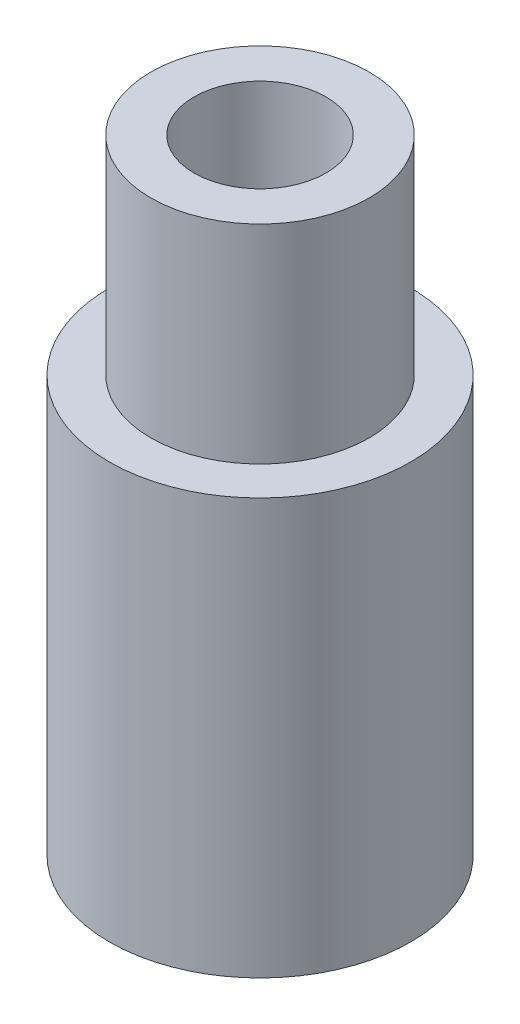
ISO-10303-21;
HEADER;
FILE_DESCRIPTION(('STEP AP214'),'2;1');
FILE_NAME('part.step','',(''),(''),'','','');
FILE_SCHEMA(('AUTOMOTIVE_DESIGN { 1 0 10303 214 1 1 1 1 }'));
ENDSEC;
DATA;
#1=APPLICATION_CONTEXT('core data for automotive mechanical design processes');
#2=APPLICATION_PROTOCOL_DEFINITION('international standard','automotive_design',2000,#1);
#3=PRODUCT_CONTEXT('',#1,'mechanical');
#4=PRODUCT('Part','Part','',(#3));
#5=PRODUCT_RELATED_PRODUCT_CATEGORY('part','',(#4));
#6=PRODUCT_DEFINITION_FORMATION('','',#4);
#7=PRODUCT_DEFINITION_CONTEXT('part definition',#1,'design');
#8=PRODUCT_DEFINITION('design','',#6,#7);
#9=PRODUCT_DEFINITION_SHAPE('','',#8);
#10=(LENGTH_UNIT() NAMED_UNIT(*) SI_UNIT(.MILLI.,.METRE.));
#11=(NAMED_UNIT(*) PLANE_ANGLE_UNIT() SI_UNIT($,.RADIAN.));
#12=(NAMED_UNIT(*) SI_UNIT($,.STERADIAN.) SOLID_ANGLE_UNIT());
#13=UNCERTAINTY_MEASURE_WITH_UNIT(LENGTH_MEASURE(1.E-05),#10,'distance_accuracy_value','');
#14=(GEOMETRIC_REPRESENTATION_CONTEXT(3) GLOBAL_UNCERTAINTY_ASSIGNED_CONTEXT((#13)) GLOBAL_UNIT_ASSIGNED_CONTEXT((#10,
#11,#12)) REPRESENTATION_CONTEXT('',''));
#15=CARTESIAN_POINT('',(0.,0.,0.));
#16=DIRECTION('',(0.,0.,1.));
#17=DIRECTION('',(1.,0.,0.));
#18=AXIS2_PLACEMENT_3D('',#15,#16,#17);
#19=CARTESIAN_POINT('',(0.,30.,0.));
#20=DIRECTION('',(0.,-1.,0.));
#21=DIRECTION('',(0.,0.,-1.));
#22=AXIS2_PLACEMENT_3D('',#19,#20,#21);
#23=CYLINDRICAL_SURFACE('',#22,3.175);
#24=CARTESIAN_POINT('',(0.,30.,0.));
#25=DIRECTION('',(0.,1.,0.));
#26=DIRECTION('',(0.,0.,1.));
#27=AXIS2_PLACEMENT_3D('',#24,#25,#26);
#28=CIRCLE('',#27,3.175);
#29=CARTESIAN_POINT('',(0.,30.,3.175));
#30=VERTEX_POINT('',#29);
#31=EDGE_CURVE('E49',#30,#30,#28,.T.);
#32=ORIENTED_EDGE('',*,*,#31,.T.);
#33=EDGE_LOOP('',(#32));
#34=FACE_BOUND('',#33,.T.);
#35=CARTESIAN_POINT('',(0.,10.,0.));
#36=DIRECTION('',(0.,-1.,0.));
#37=DIRECTION('',(0.,0.,-1.));
#38=AXIS2_PLACEMENT_3D('',#35,#36,#37);
#39=CIRCLE('',#38,3.175);
#40=CARTESIAN_POINT('',(0.,10.,-3.175));
#41=VERTEX_POINT('',#40);
#42=EDGE_CURVE('E44',#41,#41,#39,.T.);
#43=ORIENTED_EDGE('',*,*,#42,.T.);
#44=EDGE_LOOP('',(#43));
#45=FACE_BOUND('',#44,.T.);
#46=ADVANCED_FACE('F40',(#34,#45),#23,.F.);
#47=CARTESIAN_POINT('',(0.,30.,0.));
#48=DIRECTION('',(0.,1.,0.));
#49=DIRECTION('',(0.,0.,1.));
#50=AXIS2_PLACEMENT_3D('',#47,#48,#49);
#51=PLANE('',#50);
#52=ORIENTED_EDGE('',*,*,#31,.F.);
#53=EDGE_LOOP('',(#52));
#54=FACE_BOUND('',#53,.T.);
#55=CARTESIAN_POINT('',(0.,30.,0.));
#56=DIRECTION('',(0.,1.,0.));
#57=DIRECTION('',(0.,0.,1.));
#58=AXIS2_PLACEMENT_3D('',#55,#56,#57);
#59=CIRCLE('',#58,5.25);
#60=CARTESIAN_POINT('',(0.,30.,5.25));
#61=VERTEX_POINT('',#60);
#62=EDGE_CURVE('E65',#61,#61,#59,.T.);
#63=ORIENTED_EDGE('',*,*,#62,.T.);
#64=EDGE_LOOP('',(#63));
#65=FACE_BOUND('',#64,.T.);
#66=ADVANCED_FACE('F97',(#54,#65),#51,.T.);
#67=CARTESIAN_POINT('',(0.,30.,0.));
#68=DIRECTION('',(0.,-1.,0.));
#69=DIRECTION('',(0.,0.,-1.));
#70=AXIS2_PLACEMENT_3D('',#67,#68,#69);
#71=CYLINDRICAL_SURFACE('',#70,7.25);
#72=CARTESIAN_POINT('',(0.,0.,0.));
#73=DIRECTION('',(0.,1.,0.));
#74=DIRECTION('',(0.,0.,1.));
#75=AXIS2_PLACEMENT_3D('',#72,#73,#74);
#76=CIRCLE('',#75,7.25);
#77=CARTESIAN_POINT('',(0.,0.,7.25));
#78=VERTEX_POINT('',#77);
#79=EDGE_CURVE('E11',#78,#78,#76,.T.);
#80=ORIENTED_EDGE('',*,*,#79,.T.);
#81=EDGE_LOOP('',(#80));
#82=FACE_BOUND('',#81,.T.);
#83=CARTESIAN_POINT('',(0.,20.,0.));
#84=DIRECTION('',(0.,1.,0.));
#85=DIRECTION('',(0.,0.,1.));
#86=AXIS2_PLACEMENT_3D('',#83,#84,#85);
#87=CIRCLE('',#86,7.25);
#88=CARTESIAN_POINT('',(0.,20.,7.25));
#89=VERTEX_POINT('',#88);
#90=EDGE_CURVE('E55',#89,#89,#87,.T.);
#91=ORIENTED_EDGE('',*,*,#90,.F.);
#92=EDGE_LOOP('',(#91));
#93=FACE_BOUND('',#92,.T.);
#94=ADVANCED_FACE('F42',(#82,#93),#71,.T.);
#95=CARTESIAN_POINT('',(0.,0.,0.));
#96=DIRECTION('',(0.,1.,0.));
#97=DIRECTION('',(0.,0.,1.));
#98=AXIS2_PLACEMENT_3D('',#95,#96,#97);
#99=PLANE('',#98);
#100=CARTESIAN_POINT('',(0.,0.,0.));
#101=DIRECTION('',(0.,-1.,0.));
#102=DIRECTION('',(0.,0.,-1.));
#103=AXIS2_PLACEMENT_3D('',#100,#101,#102);
#104=CIRCLE('',#103,5.25);
#105=CARTESIAN_POINT('',(0.,0.,-5.25));
#106=VERTEX_POINT('',#105);
#107=EDGE_CURVE('E72',#106,#106,#104,.T.);
#108=ORIENTED_EDGE('',*,*,#107,.F.);
#109=EDGE_LOOP('',(#108));
#110=FACE_BOUND('',#109,.T.);
#111=ORIENTED_EDGE('',*,*,#79,.F.);
#112=EDGE_LOOP('',(#111));
#113=FACE_BOUND('',#112,.T.);
#114=ADVANCED_FACE('F108',(#110,#113),#99,.F.);
#115=CARTESIAN_POINT('',(0.,20.,0.));
#116=DIRECTION('',(0.,1.,0.));
#117=DIRECTION('',(0.,0.,1.));
#118=AXIS2_PLACEMENT_3D('',#115,#116,#117);
#119=PLANE('',#118);
#120=CARTESIAN_POINT('',(0.,20.,0.));
#121=DIRECTION('',(0.,1.,0.));
#122=DIRECTION('',(0.,0.,1.));
#123=AXIS2_PLACEMENT_3D('',#120,#121,#122);
#124=CIRCLE('',#123,5.25);
#125=CARTESIAN_POINT('',(0.,20.,5.25));
#126=VERTEX_POINT('',#125);
#127=EDGE_CURVE('E60',#126,#126,#124,.T.);
#128=ORIENTED_EDGE('',*,*,#127,.F.);
#129=EDGE_LOOP('',(#128));
#130=FACE_BOUND('',#129,.T.);
#131=ORIENTED_EDGE('',*,*,#90,.T.);
#132=EDGE_LOOP('',(#131));
#133=FACE_BOUND('',#132,.T.);
#134=ADVANCED_FACE('F106',(#130,#133),#119,.T.);
#135=CARTESIAN_POINT('',(0.,20.,0.));
#136=DIRECTION('',(0.,1.,0.));
#137=DIRECTION('',(0.,0.,1.));
#138=AXIS2_PLACEMENT_3D('',#135,#136,#137);
#139=CYLINDRICAL_SURFACE('',#138,5.25);
#140=ORIENTED_EDGE('',*,*,#127,.T.);
#141=EDGE_LOOP('',(#140));
#142=FACE_BOUND('',#141,.T.);
#143=ORIENTED_EDGE('',*,*,#62,.F.);
#144=EDGE_LOOP('',(#143));
#145=FACE_BOUND('',#144,.T.);
#146=ADVANCED_FACE('F93',(#142,#145),#139,.T.);
#147=CARTESIAN_POINT('',(0.,10.,0.));
#148=DIRECTION('',(0.,-1.,0.));
#149=DIRECTION('',(0.,0.,-1.));
#150=AXIS2_PLACEMENT_3D('',#147,#148,#149);
#151=CYLINDRICAL_SURFACE('',#150,5.25);
#152=CARTESIAN_POINT('',(0.,10.,0.));
#153=DIRECTION('',(0.,-1.,0.));
#154=DIRECTION('',(0.,0.,-1.));
#155=AXIS2_PLACEMENT_3D('',#152,#153,#154);
#156=CIRCLE('',#155,5.25);
#157=CARTESIAN_POINT('',(0.,10.,-5.25));
#158=VERTEX_POINT('',#157);
#159=EDGE_CURVE('E76',#158,#158,#156,.T.);
#160=ORIENTED_EDGE('',*,*,#159,.F.);
#161=EDGE_LOOP('',(#160));
#162=FACE_BOUND('',#161,.T.);
#163=ORIENTED_EDGE('',*,*,#107,.T.);
#164=EDGE_LOOP('',(#163));
#165=FACE_BOUND('',#164,.T.);
#166=ADVANCED_FACE('F88',(#162,#165),#151,.F.);
#167=CARTESIAN_POINT('',(0.,10.,0.));
#168=DIRECTION('',(0.,-1.,0.));
#169=DIRECTION('',(0.,0.,-1.));
#170=AXIS2_PLACEMENT_3D('',#167,#168,#169);
#171=PLANE('',#170);
#172=ORIENTED_EDGE('',*,*,#42,.F.);
#173=EDGE_LOOP('',(#172));
#174=FACE_BOUND('',#173,.T.);
#175=ORIENTED_EDGE('',*,*,#159,.T.);
#176=EDGE_LOOP('',(#175));
#177=FACE_BOUND('',#176,.T.);
#178=ADVANCED_FACE('F86',(#174,#177),#171,.T.);
#179=CLOSED_SHELL('',(#46,#66,#94,#114,#134,#146,#166,#178));
#180=MANIFOLD_SOLID_BREP('B2',#179);
#181=ADVANCED_BREP_SHAPE_REPRESENTATION('',(#18,#180),#14);
#182=SHAPE_DEFINITION_REPRESENTATION(#9,#181);
ENDSEC;
END-ISO-10303-21;
